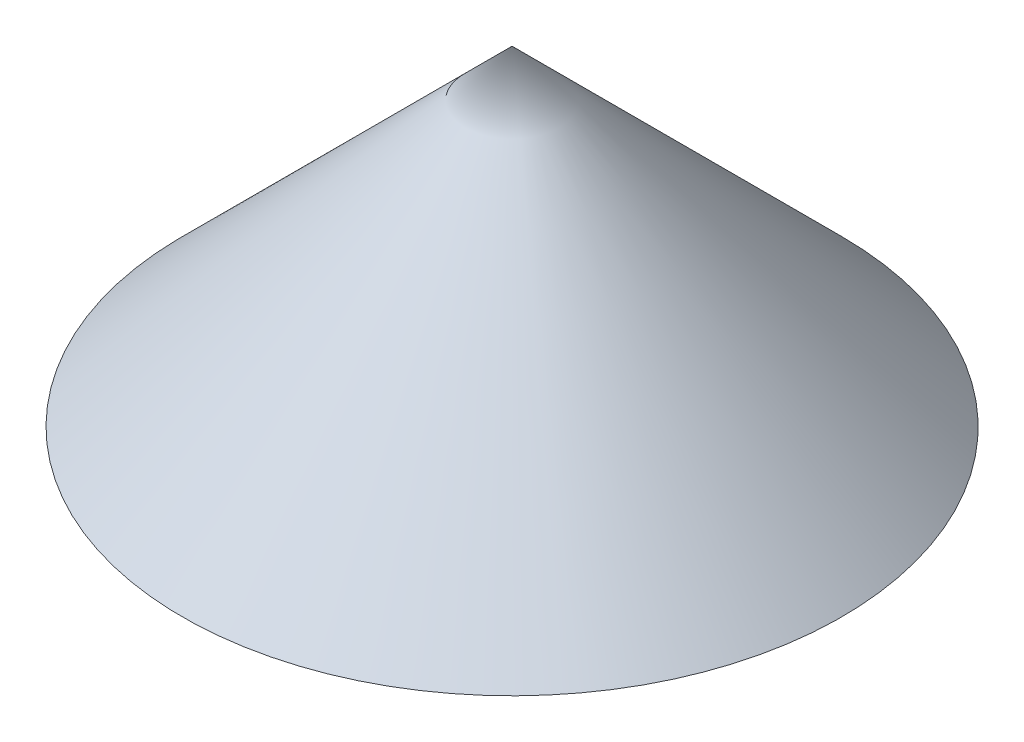
ISO-10303-21;
HEADER;
FILE_DESCRIPTION(('STEP AP214'),'2;1');
FILE_NAME('part.step','',(''),(''),'','','');
FILE_SCHEMA(('AUTOMOTIVE_DESIGN { 1 0 10303 214 1 1 1 1 }'));
ENDSEC;
DATA;
#1=APPLICATION_CONTEXT('core data for automotive mechanical design processes');
#2=APPLICATION_PROTOCOL_DEFINITION('international standard','automotive_design',2000,#1);
#3=PRODUCT_CONTEXT('',#1,'mechanical');
#4=PRODUCT('Part','Part','',(#3));
#5=PRODUCT_RELATED_PRODUCT_CATEGORY('part','',(#4));
#6=PRODUCT_DEFINITION_FORMATION('','',#4);
#7=PRODUCT_DEFINITION_CONTEXT('part definition',#1,'design');
#8=PRODUCT_DEFINITION('design','',#6,#7);
#9=PRODUCT_DEFINITION_SHAPE('','',#8);
#10=(LENGTH_UNIT() NAMED_UNIT(*) SI_UNIT(.MILLI.,.METRE.));
#11=(NAMED_UNIT(*) PLANE_ANGLE_UNIT() SI_UNIT($,.RADIAN.));
#12=(NAMED_UNIT(*) SI_UNIT($,.STERADIAN.) SOLID_ANGLE_UNIT());
#13=UNCERTAINTY_MEASURE_WITH_UNIT(LENGTH_MEASURE(1.E-05),#10,'distance_accuracy_value','');
#14=(GEOMETRIC_REPRESENTATION_CONTEXT(3) GLOBAL_UNCERTAINTY_ASSIGNED_CONTEXT((#13)) GLOBAL_UNIT_ASSIGNED_CONTEXT((#10,
#11,#12)) REPRESENTATION_CONTEXT('',''));
#15=CARTESIAN_POINT('',(0.,0.,0.));
#16=DIRECTION('',(0.,0.,1.));
#17=DIRECTION('',(1.,0.,0.));
#18=AXIS2_PLACEMENT_3D('',#15,#16,#17);
#19=CARTESIAN_POINT('',(42.0000000000005,0.,0.));
#20=DIRECTION('',(0.,-1.,0.));
#21=DIRECTION('',(0.,0.,-1.));
#22=AXIS2_PLACEMENT_3D('',#19,#20,#21);
#23=PLANE('',#22);
#24=CARTESIAN_POINT('',(0.,0.,0.));
#25=DIRECTION('',(0.,-1.,0.));
#26=DIRECTION('',(0.,0.,-1.));
#27=AXIS2_PLACEMENT_3D('',#24,#25,#26);
#28=CIRCLE('',#27,38.0000000000009);
#29=CARTESIAN_POINT('',(0.,0.,-38.0000000000009));
#30=VERTEX_POINT('',#29);
#31=EDGE_CURVE('E68',#30,#30,#28,.T.);
#32=ORIENTED_EDGE('',*,*,#31,.F.);
#33=EDGE_LOOP('',(#32));
#34=FACE_BOUND('',#33,.T.);
#35=CARTESIAN_POINT('',(0.,0.,0.));
#36=DIRECTION('',(0.,-1.,0.));
#37=DIRECTION('',(0.,0.,-1.));
#38=AXIS2_PLACEMENT_3D('',#35,#36,#37);
#39=CIRCLE('',#38,42.0000000000005);
#40=CARTESIAN_POINT('',(0.,0.,-42.0000000000005));
#41=VERTEX_POINT('',#40);
#42=EDGE_CURVE('E11',#41,#41,#39,.T.);
#43=ORIENTED_EDGE('',*,*,#42,.T.);
#44=EDGE_LOOP('',(#43));
#45=FACE_BOUND('',#44,.T.);
#46=ADVANCED_FACE('F36',(#34,#45),#23,.T.);
#47=CARTESIAN_POINT('',(0.,0.,0.));
#48=DIRECTION('',(0.,-1.,0.));
#49=DIRECTION('',(0.,0.,-1.));
#50=AXIS2_PLACEMENT_3D('',#47,#48,#49);
#51=CONICAL_SURFACE('',#50,42.0000000000005,0.785398163397454);
#52=CARTESIAN_POINT('',(0.,42.,0.));
#53=VERTEX_POINT('',#52);
#54=VERTEX_LOOP('',#53);
#55=FACE_BOUND('',#54,.T.);
#56=ORIENTED_EDGE('',*,*,#42,.F.);
#57=EDGE_LOOP('',(#56));
#58=FACE_BOUND('',#57,.T.);
#59=ADVANCED_FACE('F45',(#55,#58),#51,.T.);
#60=CARTESIAN_POINT('',(0.,0.,0.));
#61=DIRECTION('',(0.,-1.,0.));
#62=DIRECTION('',(0.,0.,-1.));
#63=AXIS2_PLACEMENT_3D('',#60,#61,#62);
#64=CYLINDRICAL_SURFACE('',#63,6.34249842882945);
#65=CARTESIAN_POINT('',(0.,31.6575015711707,0.));
#66=DIRECTION('',(0.,-1.,0.));
#67=DIRECTION('',(0.,0.,-1.));
#68=AXIS2_PLACEMENT_3D('',#65,#66,#67);
#69=CIRCLE('',#68,6.34249842882945);
#70=CARTESIAN_POINT('',(0.,31.6575015711707,-6.34249842882945));
#71=VERTEX_POINT('',#70);
#72=EDGE_CURVE('E70',#71,#71,#69,.T.);
#73=ORIENTED_EDGE('',*,*,#72,.T.);
#74=EDGE_LOOP('',(#73));
#75=FACE_BOUND('',#74,.T.);
#76=CARTESIAN_POINT('',(0.,0.,0.));
#77=DIRECTION('',(0.,-1.,0.));
#78=DIRECTION('',(0.,0.,-1.));
#79=AXIS2_PLACEMENT_3D('',#76,#77,#78);
#80=CIRCLE('',#79,6.34249842882945);
#81=CARTESIAN_POINT('',(0.,0.,-6.34249842882945));
#82=VERTEX_POINT('',#81);
#83=EDGE_CURVE('E42',#82,#82,#80,.T.);
#84=ORIENTED_EDGE('',*,*,#83,.F.);
#85=EDGE_LOOP('',(#84));
#86=FACE_BOUND('',#85,.T.);
#87=ADVANCED_FACE('F48',(#75,#86),#64,.T.);
#88=CARTESIAN_POINT('',(0.,31.6575015711707,0.));
#89=DIRECTION('',(0.,-1.,0.));
#90=DIRECTION('',(0.,0.,-1.));
#91=AXIS2_PLACEMENT_3D('',#88,#89,#90);
#92=CONICAL_SURFACE('',#91,6.34249842882945,0.78539816339746);
#93=ORIENTED_EDGE('',*,*,#31,.T.);
#94=EDGE_LOOP('',(#93));
#95=FACE_BOUND('',#94,.T.);
#96=ORIENTED_EDGE('',*,*,#72,.F.);
#97=EDGE_LOOP('',(#96));
#98=FACE_BOUND('',#97,.T.);
#99=ADVANCED_FACE('F58',(#95,#98),#92,.F.);
#100=ORIENTED_EDGE('',*,*,#83,.T.);
#101=EDGE_LOOP('',(#100));
#102=FACE_BOUND('',#101,.T.);
#103=ADVANCED_FACE('F53',(#102),#23,.T.);
#104=CLOSED_SHELL('',(#46,#59,#87,#99,#103));
#105=MANIFOLD_SOLID_BREP('B2',#104);
#106=ADVANCED_BREP_SHAPE_REPRESENTATION('',(#18,#105),#14);
#107=SHAPE_DEFINITION_REPRESENTATION(#9,#106);
ENDSEC;
END-ISO-10303-21;
